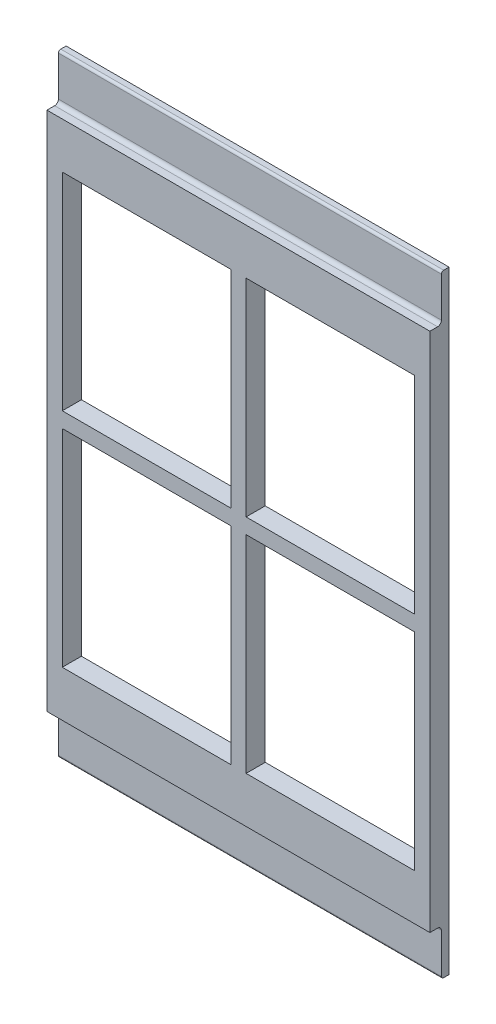
ISO-10303-21;
HEADER;
FILE_DESCRIPTION(('STEP AP214'),'2;1');
FILE_NAME('part.step','',(''),(''),'','','');
FILE_SCHEMA(('AUTOMOTIVE_DESIGN { 1 0 10303 214 1 1 1 1 }'));
ENDSEC;
DATA;
#1=APPLICATION_CONTEXT('core data for automotive mechanical design processes');
#2=APPLICATION_PROTOCOL_DEFINITION('international standard','automotive_design',2000,#1);
#3=PRODUCT_CONTEXT('',#1,'mechanical');
#4=PRODUCT('Part','Part','',(#3));
#5=PRODUCT_RELATED_PRODUCT_CATEGORY('part','',(#4));
#6=PRODUCT_DEFINITION_FORMATION('','',#4);
#7=PRODUCT_DEFINITION_CONTEXT('part definition',#1,'design');
#8=PRODUCT_DEFINITION('design','',#6,#7);
#9=PRODUCT_DEFINITION_SHAPE('','',#8);
#10=(LENGTH_UNIT() NAMED_UNIT(*) SI_UNIT(.MILLI.,.METRE.));
#11=(NAMED_UNIT(*) PLANE_ANGLE_UNIT() SI_UNIT($,.RADIAN.));
#12=(NAMED_UNIT(*) SI_UNIT($,.STERADIAN.) SOLID_ANGLE_UNIT());
#13=UNCERTAINTY_MEASURE_WITH_UNIT(LENGTH_MEASURE(1.E-05),#10,'distance_accuracy_value','');
#14=(GEOMETRIC_REPRESENTATION_CONTEXT(3) GLOBAL_UNCERTAINTY_ASSIGNED_CONTEXT((#13)) GLOBAL_UNIT_ASSIGNED_CONTEXT((#10,
#11,#12)) REPRESENTATION_CONTEXT('',''));
#15=CARTESIAN_POINT('',(0.,0.,0.));
#16=DIRECTION('',(0.,0.,1.));
#17=DIRECTION('',(1.,0.,0.));
#18=AXIS2_PLACEMENT_3D('',#15,#16,#17);
#19=CARTESIAN_POINT('',(-17.9629629629629,-37.8803703703704,2.5));
#20=DIRECTION('',(0.,0.,1.));
#21=DIRECTION('',(1.,0.,0.));
#22=AXIS2_PLACEMENT_3D('',#19,#20,#21);
#23=PLANE('',#22);
#24=DIRECTION('',(0.,-1.,0.));
#25=VECTOR('',#24,1.);
#26=CARTESIAN_POINT('',(-15.9629629629629,0.,2.5));
#27=LINE('',#26,#25);
#28=CARTESIAN_POINT('',(-15.9629629629629,1.12962962962963,2.5));
#29=VERTEX_POINT('',#28);
#30=CARTESIAN_POINT('',(-15.9629629629629,-25.8703703703704,2.5));
#31=VERTEX_POINT('',#30);
#32=EDGE_CURVE('E315',#29,#31,#27,.T.);
#33=ORIENTED_EDGE('',*,*,#32,.F.);
#34=DIRECTION('',(1.,0.,0.));
#35=VECTOR('',#34,1.);
#36=CARTESIAN_POINT('',(0.,1.12962962962963,2.5));
#37=LINE('',#36,#35);
#38=CARTESIAN_POINT('',(6.03703703703705,1.12962962962963,2.5));
#39=VERTEX_POINT('',#38);
#40=EDGE_CURVE('E343',#29,#39,#37,.T.);
#41=ORIENTED_EDGE('',*,*,#40,.T.);
#42=DIRECTION('',(0.,-1.,0.));
#43=VECTOR('',#42,1.);
#44=CARTESIAN_POINT('',(6.03703703703705,0.,2.5));
#45=LINE('',#44,#43);
#46=CARTESIAN_POINT('',(6.03703703703706,-25.8703703703704,2.5));
#47=VERTEX_POINT('',#46);
#48=EDGE_CURVE('E253',#39,#47,#45,.T.);
#49=ORIENTED_EDGE('',*,*,#48,.T.);
#50=DIRECTION('',(1.,0.,0.));
#51=VECTOR('',#50,1.);
#52=CARTESIAN_POINT('',(0.,-25.8703703703704,2.5));
#53=LINE('',#52,#51);
#54=EDGE_CURVE('E324',#31,#47,#53,.T.);
#55=ORIENTED_EDGE('',*,*,#54,.F.);
#56=EDGE_LOOP('',(#33,#41,#49,#55));
#57=FACE_BOUND('',#56,.T.);
#58=DIRECTION('',(0.,1.,0.));
#59=VECTOR('',#58,1.);
#60=CARTESIAN_POINT('',(-17.9629629629629,0.,2.5));
#61=LINE('',#60,#59);
#62=CARTESIAN_POINT('',(-17.9629629629629,-31.8703703703704,2.5));
#63=VERTEX_POINT('',#62);
#64=CARTESIAN_POINT('',(-17.9629629629629,36.1296296296296,2.5));
#65=VERTEX_POINT('',#64);
#66=EDGE_CURVE('E225',#63,#65,#61,.T.);
#67=ORIENTED_EDGE('',*,*,#66,.F.);
#68=DIRECTION('',(1.,0.,0.));
#69=VECTOR('',#68,1.);
#70=CARTESIAN_POINT('',(-17.9629629629629,-31.8703703703704,2.5));
#71=LINE('',#70,#69);
#72=CARTESIAN_POINT('',(32.0370370370371,-31.8703703703704,2.5));
#73=VERTEX_POINT('',#72);
#74=EDGE_CURVE('E241',#63,#73,#71,.T.);
#75=ORIENTED_EDGE('',*,*,#74,.T.);
#76=DIRECTION('',(0.,-1.,0.));
#77=VECTOR('',#76,1.);
#78=CARTESIAN_POINT('',(32.0370370370371,0.,2.5));
#79=LINE('',#78,#77);
#80=CARTESIAN_POINT('',(32.0370370370371,36.1296296296296,2.5));
#81=VERTEX_POINT('',#80);
#82=EDGE_CURVE('E243',#81,#73,#79,.T.);
#83=ORIENTED_EDGE('',*,*,#82,.F.);
#84=DIRECTION('',(1.,0.,0.));
#85=VECTOR('',#84,1.);
#86=CARTESIAN_POINT('',(-17.9629629629629,36.1296296296296,2.5));
#87=LINE('',#86,#85);
#88=EDGE_CURVE('E242',#65,#81,#87,.T.);
#89=ORIENTED_EDGE('',*,*,#88,.F.);
#90=EDGE_LOOP('',(#67,#75,#83,#89));
#91=FACE_BOUND('',#90,.T.);
#92=DIRECTION('',(0.,-1.,0.));
#93=VECTOR('',#92,1.);
#94=CARTESIAN_POINT('',(-15.9629629629629,0.,2.5));
#95=LINE('',#94,#93);
#96=CARTESIAN_POINT('',(-15.9629629629629,30.1321166393185,2.5));
#97=VERTEX_POINT('',#96);
#98=CARTESIAN_POINT('',(-15.9629629629629,3.12962962962963,2.5));
#99=VERTEX_POINT('',#98);
#100=EDGE_CURVE('E331',#97,#99,#95,.T.);
#101=ORIENTED_EDGE('',*,*,#100,.F.);
#102=DIRECTION('',(1.,0.,0.));
#103=VECTOR('',#102,1.);
#104=CARTESIAN_POINT('',(0.,30.1321166393185,2.5));
#105=LINE('',#104,#103);
#106=CARTESIAN_POINT('',(6.03703703703705,30.1321166393185,2.5));
#107=VERTEX_POINT('',#106);
#108=EDGE_CURVE('E244',#97,#107,#105,.T.);
#109=ORIENTED_EDGE('',*,*,#108,.T.);
#110=DIRECTION('',(0.,-1.,0.));
#111=VECTOR('',#110,1.);
#112=CARTESIAN_POINT('',(6.03703703703705,0.,2.5));
#113=LINE('',#112,#111);
#114=CARTESIAN_POINT('',(6.03703703703705,3.12962962962963,2.5));
#115=VERTEX_POINT('',#114);
#116=EDGE_CURVE('E337',#107,#115,#113,.T.);
#117=ORIENTED_EDGE('',*,*,#116,.T.);
#118=DIRECTION('',(1.,0.,0.));
#119=VECTOR('',#118,1.);
#120=CARTESIAN_POINT('',(0.,3.12962962962963,2.5));
#121=LINE('',#120,#119);
#122=EDGE_CURVE('E311',#99,#115,#121,.T.);
#123=ORIENTED_EDGE('',*,*,#122,.F.);
#124=EDGE_LOOP('',(#101,#109,#117,#123));
#125=FACE_BOUND('',#124,.T.);
#126=DIRECTION('',(0.,-1.,0.));
#127=VECTOR('',#126,1.);
#128=CARTESIAN_POINT('',(8.03703703703706,0.,2.5));
#129=LINE('',#128,#127);
#130=CARTESIAN_POINT('',(8.03703703703706,1.12962962962964,2.5));
#131=VERTEX_POINT('',#130);
#132=CARTESIAN_POINT('',(8.03703703703706,-25.8703703703704,2.5));
#133=VERTEX_POINT('',#132);
#134=EDGE_CURVE('E321',#131,#133,#129,.T.);
#135=ORIENTED_EDGE('',*,*,#134,.F.);
#136=DIRECTION('',(1.,0.,0.));
#137=VECTOR('',#136,1.);
#138=CARTESIAN_POINT('',(0.,1.12962962962963,2.5));
#139=LINE('',#138,#137);
#140=CARTESIAN_POINT('',(30.0370370370371,1.12962962962964,2.5));
#141=VERTEX_POINT('',#140);
#142=EDGE_CURVE('E250',#131,#141,#139,.T.);
#143=ORIENTED_EDGE('',*,*,#142,.T.);
#144=DIRECTION('',(0.,1.,0.));
#145=VECTOR('',#144,1.);
#146=CARTESIAN_POINT('',(30.0370370370371,0.,2.5));
#147=LINE('',#146,#145);
#148=CARTESIAN_POINT('',(30.0370370370371,-25.8703703703704,2.5));
#149=VERTEX_POINT('',#148);
#150=EDGE_CURVE('E319',#149,#141,#147,.T.);
#151=ORIENTED_EDGE('',*,*,#150,.F.);
#152=DIRECTION('',(1.,0.,0.));
#153=VECTOR('',#152,1.);
#154=CARTESIAN_POINT('',(0.,-25.8703703703704,2.5));
#155=LINE('',#154,#153);
#156=EDGE_CURVE('E313',#133,#149,#155,.T.);
#157=ORIENTED_EDGE('',*,*,#156,.F.);
#158=EDGE_LOOP('',(#135,#143,#151,#157));
#159=FACE_BOUND('',#158,.T.);
#160=DIRECTION('',(0.,-1.,0.));
#161=VECTOR('',#160,1.);
#162=CARTESIAN_POINT('',(8.03703703703706,0.,2.5));
#163=LINE('',#162,#161);
#164=CARTESIAN_POINT('',(8.03703703703705,30.1321166393185,2.5));
#165=VERTEX_POINT('',#164);
#166=CARTESIAN_POINT('',(8.03703703703706,3.12962962962963,2.5));
#167=VERTEX_POINT('',#166);
#168=EDGE_CURVE('E328',#165,#167,#163,.T.);
#169=ORIENTED_EDGE('',*,*,#168,.F.);
#170=DIRECTION('',(1.,0.,0.));
#171=VECTOR('',#170,1.);
#172=CARTESIAN_POINT('',(0.,30.1321166393185,2.5));
#173=LINE('',#172,#171);
#174=CARTESIAN_POINT('',(30.0370370370371,30.1321166393185,2.5));
#175=VERTEX_POINT('',#174);
#176=EDGE_CURVE('E340',#165,#175,#173,.T.);
#177=ORIENTED_EDGE('',*,*,#176,.T.);
#178=DIRECTION('',(0.,1.,0.));
#179=VECTOR('',#178,1.);
#180=CARTESIAN_POINT('',(30.0370370370371,0.,2.5));
#181=LINE('',#180,#179);
#182=CARTESIAN_POINT('',(30.0370370370371,3.12962962962964,2.5));
#183=VERTEX_POINT('',#182);
#184=EDGE_CURVE('E326',#183,#175,#181,.T.);
#185=ORIENTED_EDGE('',*,*,#184,.F.);
#186=DIRECTION('',(1.,0.,0.));
#187=VECTOR('',#186,1.);
#188=CARTESIAN_POINT('',(0.,3.12962962962963,2.5));
#189=LINE('',#188,#187);
#190=EDGE_CURVE('E317',#167,#183,#189,.T.);
#191=ORIENTED_EDGE('',*,*,#190,.F.);
#192=EDGE_LOOP('',(#169,#177,#185,#191));
#193=FACE_BOUND('',#192,.T.);
#194=ADVANCED_FACE('F35',(#57,#91,#125,#159,#193),#23,.T.);
#195=CARTESIAN_POINT('',(-17.9629629629629,0.,1.));
#196=DIRECTION('',(0.,0.,-1.));
#197=DIRECTION('',(0.,1.,0.));
#198=AXIS2_PLACEMENT_3D('',#195,#196,#197);
#199=PLANE('',#198);
#200=DIRECTION('',(0.,1.,0.));
#201=VECTOR('',#200,1.);
#202=CARTESIAN_POINT('',(32.0370370370371,0.,1.));
#203=LINE('',#202,#201);
#204=CARTESIAN_POINT('',(32.0370370370371,36.6296296296296,1.));
#205=VERTEX_POINT('',#204);
#206=CARTESIAN_POINT('',(32.0370370370371,41.8296296296297,1.));
#207=VERTEX_POINT('',#206);
#208=EDGE_CURVE('E43',#205,#207,#203,.T.);
#209=ORIENTED_EDGE('',*,*,#208,.T.);
#210=DIRECTION('',(1.,0.,0.));
#211=VECTOR('',#210,1.);
#212=CARTESIAN_POINT('',(-17.9629629629629,41.8296296296297,1.));
#213=LINE('',#212,#211);
#214=CARTESIAN_POINT('',(-17.9629629629629,41.8296296296297,1.));
#215=VERTEX_POINT('',#214);
#216=EDGE_CURVE('E509',#207,#215,#213,.F.);
#217=ORIENTED_EDGE('',*,*,#216,.T.);
#218=DIRECTION('',(0.,1.,0.));
#219=VECTOR('',#218,1.);
#220=CARTESIAN_POINT('',(-17.9629629629629,0.,1.));
#221=LINE('',#220,#219);
#222=CARTESIAN_POINT('',(-17.9629629629629,36.6296296296296,1.));
#223=VERTEX_POINT('',#222);
#224=EDGE_CURVE('E297',#223,#215,#221,.T.);
#225=ORIENTED_EDGE('',*,*,#224,.F.);
#226=DIRECTION('',(1.,0.,0.));
#227=VECTOR('',#226,1.);
#228=CARTESIAN_POINT('',(-17.9629629629629,36.6296296296296,1.));
#229=LINE('',#228,#227);
#230=EDGE_CURVE('E260',#223,#205,#229,.T.);
#231=ORIENTED_EDGE('',*,*,#230,.T.);
#232=EDGE_LOOP('',(#209,#217,#225,#231));
#233=FACE_BOUND('',#232,.T.);
#234=ADVANCED_FACE('F446',(#233),#199,.F.);
#235=CARTESIAN_POINT('',(0.,41.8296296296297,0.7));
#236=DIRECTION('',(-1.,0.,0.));
#237=DIRECTION('',(0.,0.,1.));
#238=AXIS2_PLACEMENT_3D('',#235,#236,#237);
#239=CYLINDRICAL_SURFACE('',#238,0.3);
#240=CARTESIAN_POINT('',(-17.9629629629629,41.8296296296297,0.7));
#241=DIRECTION('',(-1.,0.,0.));
#242=DIRECTION('',(0.,0.,1.));
#243=AXIS2_PLACEMENT_3D('',#240,#241,#242);
#244=CIRCLE('',#243,0.3);
#245=CARTESIAN_POINT('',(-17.9629629629629,42.1296296296296,0.7));
#246=VERTEX_POINT('',#245);
#247=EDGE_CURVE('E483',#215,#246,#244,.T.);
#248=ORIENTED_EDGE('',*,*,#247,.F.);
#249=ORIENTED_EDGE('',*,*,#216,.F.);
#250=CARTESIAN_POINT('',(32.0370370370371,41.8296296296297,0.7));
#251=DIRECTION('',(1.,0.,0.));
#252=DIRECTION('',(0.,1.,0.));
#253=AXIS2_PLACEMENT_3D('',#250,#251,#252);
#254=CIRCLE('',#253,0.3);
#255=CARTESIAN_POINT('',(32.0370370370371,42.1296296296296,0.7));
#256=VERTEX_POINT('',#255);
#257=EDGE_CURVE('E484',#256,#207,#254,.T.);
#258=ORIENTED_EDGE('',*,*,#257,.F.);
#259=DIRECTION('',(1.,0.,0.));
#260=VECTOR('',#259,1.);
#261=CARTESIAN_POINT('',(32.0370370370371,42.1296296296296,0.7));
#262=LINE('',#261,#260);
#263=EDGE_CURVE('E479',#246,#256,#262,.T.);
#264=ORIENTED_EDGE('',*,*,#263,.F.);
#265=EDGE_LOOP('',(#248,#249,#258,#264));
#266=FACE_BOUND('',#265,.T.);
#267=ADVANCED_FACE('F448',(#266),#239,.T.);
#268=CARTESIAN_POINT('',(0.,42.1296296296296,5.));
#269=DIRECTION('',(0.,1.,0.));
#270=DIRECTION('',(0.,0.,1.));
#271=AXIS2_PLACEMENT_3D('',#268,#269,#270);
#272=PLANE('',#271);
#273=DIRECTION('',(0.,0.,-1.));
#274=VECTOR('',#273,1.);
#275=CARTESIAN_POINT('',(-17.9629629629629,42.1296296296296,5.));
#276=LINE('',#275,#274);
#277=CARTESIAN_POINT('',(-17.9629629629629,42.1296296296296,0.));
#278=VERTEX_POINT('',#277);
#279=EDGE_CURVE('E272',#246,#278,#276,.T.);
#280=ORIENTED_EDGE('',*,*,#279,.F.);
#281=ORIENTED_EDGE('',*,*,#263,.T.);
#282=DIRECTION('',(0.,0.,-1.));
#283=VECTOR('',#282,1.);
#284=CARTESIAN_POINT('',(32.0370370370371,42.1296296296296,5.));
#285=LINE('',#284,#283);
#286=CARTESIAN_POINT('',(32.0370370370371,42.1296296296296,0.));
#287=VERTEX_POINT('',#286);
#288=EDGE_CURVE('E270',#256,#287,#285,.T.);
#289=ORIENTED_EDGE('',*,*,#288,.T.);
#290=DIRECTION('',(1.,0.,0.));
#291=VECTOR('',#290,1.);
#292=CARTESIAN_POINT('',(0.,42.1296296296296,0.));
#293=LINE('',#292,#291);
#294=EDGE_CURVE('E399',#278,#287,#293,.T.);
#295=ORIENTED_EDGE('',*,*,#294,.F.);
#296=EDGE_LOOP('',(#280,#281,#289,#295));
#297=FACE_BOUND('',#296,.T.);
#298=ADVANCED_FACE('F455',(#297),#272,.T.);
#299=CARTESIAN_POINT('',(0.,30.1321166393185,5.));
#300=DIRECTION('',(0.,1.,0.));
#301=DIRECTION('',(-1.,0.,0.));
#302=AXIS2_PLACEMENT_3D('',#299,#300,#301);
#303=PLANE('',#302);
#304=ORIENTED_EDGE('',*,*,#108,.F.);
#305=DIRECTION('',(0.,0.,-1.));
#306=VECTOR('',#305,1.);
#307=CARTESIAN_POINT('',(-15.9629629629629,30.1321166393185,5.));
#308=LINE('',#307,#306);
#309=CARTESIAN_POINT('',(-15.9629629629629,30.1321166393185,0.));
#310=VERTEX_POINT('',#309);
#311=EDGE_CURVE('E257',#97,#310,#308,.T.);
#312=ORIENTED_EDGE('',*,*,#311,.T.);
#313=DIRECTION('',(1.,0.,0.));
#314=VECTOR('',#313,1.);
#315=CARTESIAN_POINT('',(0.,30.1321166393185,0.));
#316=LINE('',#315,#314);
#317=CARTESIAN_POINT('',(6.03703703703705,30.1321166393185,0.));
#318=VERTEX_POINT('',#317);
#319=EDGE_CURVE('E383',#310,#318,#316,.T.);
#320=ORIENTED_EDGE('',*,*,#319,.T.);
#321=DIRECTION('',(0.,0.,-1.));
#322=VECTOR('',#321,1.);
#323=CARTESIAN_POINT('',(6.03703703703705,30.1321166393185,5.));
#324=LINE('',#323,#322);
#325=EDGE_CURVE('E259',#107,#318,#324,.T.);
#326=ORIENTED_EDGE('',*,*,#325,.F.);
#327=EDGE_LOOP('',(#304,#312,#320,#326));
#328=FACE_BOUND('',#327,.T.);
#329=ADVANCED_FACE('F431',(#328),#303,.F.);
#330=ORIENTED_EDGE('',*,*,#176,.F.);
#331=DIRECTION('',(0.,0.,-1.));
#332=VECTOR('',#331,1.);
#333=CARTESIAN_POINT('',(8.03703703703705,30.1321166393185,5.));
#334=LINE('',#333,#332);
#335=CARTESIAN_POINT('',(8.03703703703705,30.1321166393185,0.));
#336=VERTEX_POINT('',#335);
#337=EDGE_CURVE('E274',#165,#336,#334,.T.);
#338=ORIENTED_EDGE('',*,*,#337,.T.);
#339=CARTESIAN_POINT('',(30.0370370370371,30.1321166393185,0.));
#340=VERTEX_POINT('',#339);
#341=EDGE_CURVE('E391',#336,#340,#316,.T.);
#342=ORIENTED_EDGE('',*,*,#341,.T.);
#343=DIRECTION('',(0.,0.,-1.));
#344=VECTOR('',#343,1.);
#345=CARTESIAN_POINT('',(30.0370370370371,30.1321166393185,5.));
#346=LINE('',#345,#344);
#347=EDGE_CURVE('E276',#175,#340,#346,.T.);
#348=ORIENTED_EDGE('',*,*,#347,.F.);
#349=EDGE_LOOP('',(#330,#338,#342,#348));
#350=FACE_BOUND('',#349,.T.);
#351=ADVANCED_FACE('F474',(#350),#303,.F.);
#352=CARTESIAN_POINT('',(6.03703703703705,0.,5.));
#353=DIRECTION('',(1.,0.,0.));
#354=DIRECTION('',(0.,1.,0.));
#355=AXIS2_PLACEMENT_3D('',#352,#353,#354);
#356=PLANE('',#355);
#357=ORIENTED_EDGE('',*,*,#48,.F.);
#358=DIRECTION('',(0.,0.,-1.));
#359=VECTOR('',#358,1.);
#360=CARTESIAN_POINT('',(6.03703703703705,1.12962962962963,5.));
#361=LINE('',#360,#359);
#362=CARTESIAN_POINT('',(6.03703703703705,1.12962962962963,0.));
#363=VERTEX_POINT('',#362);
#364=EDGE_CURVE('E282',#39,#363,#361,.T.);
#365=ORIENTED_EDGE('',*,*,#364,.T.);
#366=DIRECTION('',(0.,-1.,0.));
#367=VECTOR('',#366,1.);
#368=CARTESIAN_POINT('',(6.03703703703705,0.,0.));
#369=LINE('',#368,#367);
#370=CARTESIAN_POINT('',(6.03703703703706,-25.8703703703704,0.));
#371=VERTEX_POINT('',#370);
#372=EDGE_CURVE('E356',#363,#371,#369,.T.);
#373=ORIENTED_EDGE('',*,*,#372,.T.);
#374=DIRECTION('',(0.,0.,-1.));
#375=VECTOR('',#374,1.);
#376=CARTESIAN_POINT('',(6.03703703703706,-25.8703703703704,5.));
#377=LINE('',#376,#375);
#378=EDGE_CURVE('E284',#47,#371,#377,.T.);
#379=ORIENTED_EDGE('',*,*,#378,.F.);
#380=EDGE_LOOP('',(#357,#365,#373,#379));
#381=FACE_BOUND('',#380,.T.);
#382=ADVANCED_FACE('F354',(#381),#356,.F.);
#383=CARTESIAN_POINT('',(0.,1.12962962962963,5.));
#384=DIRECTION('',(0.,1.,0.));
#385=DIRECTION('',(-1.,0.,0.));
#386=AXIS2_PLACEMENT_3D('',#383,#384,#385);
#387=PLANE('',#386);
#388=ORIENTED_EDGE('',*,*,#142,.F.);
#389=DIRECTION('',(0.,0.,-1.));
#390=VECTOR('',#389,1.);
#391=CARTESIAN_POINT('',(8.03703703703706,1.12962962962964,5.));
#392=LINE('',#391,#390);
#393=CARTESIAN_POINT('',(8.03703703703706,1.12962962962964,0.));
#394=VERTEX_POINT('',#393);
#395=EDGE_CURVE('E50',#131,#394,#392,.T.);
#396=ORIENTED_EDGE('',*,*,#395,.T.);
#397=DIRECTION('',(1.,0.,0.));
#398=VECTOR('',#397,1.);
#399=CARTESIAN_POINT('',(0.,1.12962962962963,0.));
#400=LINE('',#399,#398);
#401=CARTESIAN_POINT('',(30.0370370370371,1.12962962962964,0.));
#402=VERTEX_POINT('',#401);
#403=EDGE_CURVE('E536',#394,#402,#400,.T.);
#404=ORIENTED_EDGE('',*,*,#403,.T.);
#405=DIRECTION('',(0.,0.,-1.));
#406=VECTOR('',#405,1.);
#407=CARTESIAN_POINT('',(30.0370370370371,1.12962962962964,5.));
#408=LINE('',#407,#406);
#409=EDGE_CURVE('E58',#141,#402,#408,.T.);
#410=ORIENTED_EDGE('',*,*,#409,.F.);
#411=EDGE_LOOP('',(#388,#396,#404,#410));
#412=FACE_BOUND('',#411,.T.);
#413=ADVANCED_FACE('F583',(#412),#387,.F.);
#414=CARTESIAN_POINT('',(0.,0.,0.));
#415=DIRECTION('',(0.,0.,1.));
#416=DIRECTION('',(1.,0.,0.));
#417=AXIS2_PLACEMENT_3D('',#414,#415,#416);
#418=PLANE('',#417);
#419=DIRECTION('',(0.,-1.,0.));
#420=VECTOR('',#419,1.);
#421=CARTESIAN_POINT('',(8.03703703703706,0.,0.));
#422=LINE('',#421,#420);
#423=CARTESIAN_POINT('',(8.03703703703706,-25.8703703703704,0.));
#424=VERTEX_POINT('',#423);
#425=EDGE_CURVE('E418',#394,#424,#422,.T.);
#426=ORIENTED_EDGE('',*,*,#425,.T.);
#427=DIRECTION('',(1.,0.,0.));
#428=VECTOR('',#427,1.);
#429=CARTESIAN_POINT('',(0.,-25.8703703703704,0.));
#430=LINE('',#429,#428);
#431=CARTESIAN_POINT('',(30.0370370370371,-25.8703703703704,0.));
#432=VERTEX_POINT('',#431);
#433=EDGE_CURVE('E378',#424,#432,#430,.T.);
#434=ORIENTED_EDGE('',*,*,#433,.T.);
#435=DIRECTION('',(0.,1.,0.));
#436=VECTOR('',#435,1.);
#437=CARTESIAN_POINT('',(30.0370370370371,0.,0.));
#438=LINE('',#437,#436);
#439=EDGE_CURVE('E539',#432,#402,#438,.T.);
#440=ORIENTED_EDGE('',*,*,#439,.T.);
#441=ORIENTED_EDGE('',*,*,#403,.F.);
#442=EDGE_LOOP('',(#426,#434,#440,#441));
#443=FACE_BOUND('',#442,.T.);
#444=DIRECTION('',(1.,0.,0.));
#445=VECTOR('',#444,1.);
#446=CARTESIAN_POINT('',(0.,1.12962962962963,0.));
#447=LINE('',#446,#445);
#448=CARTESIAN_POINT('',(-15.9629629629629,1.12962962962963,0.));
#449=VERTEX_POINT('',#448);
#450=EDGE_CURVE('E372',#449,#363,#447,.T.);
#451=ORIENTED_EDGE('',*,*,#450,.F.);
#452=DIRECTION('',(0.,-1.,0.));
#453=VECTOR('',#452,1.);
#454=CARTESIAN_POINT('',(-15.9629629629629,0.,0.));
#455=LINE('',#454,#453);
#456=CARTESIAN_POINT('',(-15.9629629629629,-25.8703703703704,0.));
#457=VERTEX_POINT('',#456);
#458=EDGE_CURVE('E367',#449,#457,#455,.T.);
#459=ORIENTED_EDGE('',*,*,#458,.T.);
#460=EDGE_CURVE('E361',#457,#371,#430,.T.);
#461=ORIENTED_EDGE('',*,*,#460,.T.);
#462=ORIENTED_EDGE('',*,*,#372,.F.);
#463=EDGE_LOOP('',(#451,#459,#461,#462));
#464=FACE_BOUND('',#463,.T.);
#465=CARTESIAN_POINT('',(8.03703703703706,3.12962962962963,0.));
#466=VERTEX_POINT('',#465);
#467=EDGE_CURVE('E415',#336,#466,#422,.T.);
#468=ORIENTED_EDGE('',*,*,#467,.T.);
#469=DIRECTION('',(1.,0.,0.));
#470=VECTOR('',#469,1.);
#471=CARTESIAN_POINT('',(0.,3.12962962962963,0.));
#472=LINE('',#471,#470);
#473=CARTESIAN_POINT('',(30.0370370370371,3.12962962962964,0.));
#474=VERTEX_POINT('',#473);
#475=EDGE_CURVE('E411',#466,#474,#472,.T.);
#476=ORIENTED_EDGE('',*,*,#475,.T.);
#477=EDGE_CURVE('E413',#474,#340,#438,.T.);
#478=ORIENTED_EDGE('',*,*,#477,.T.);
#479=ORIENTED_EDGE('',*,*,#341,.F.);
#480=EDGE_LOOP('',(#468,#476,#478,#479));
#481=FACE_BOUND('',#480,.T.);
#482=DIRECTION('',(0.,1.,0.));
#483=VECTOR('',#482,1.);
#484=CARTESIAN_POINT('',(-17.9629629629629,0.,0.));
#485=LINE('',#484,#483);
#486=CARTESIAN_POINT('',(-17.9629629629629,-37.8703703703704,0.));
#487=VERTEX_POINT('',#486);
#488=EDGE_CURVE('E408',#487,#278,#485,.T.);
#489=ORIENTED_EDGE('',*,*,#488,.T.);
#490=ORIENTED_EDGE('',*,*,#294,.T.);
#491=DIRECTION('',(0.,-1.,0.));
#492=VECTOR('',#491,1.);
#493=CARTESIAN_POINT('',(32.0370370370371,0.,0.));
#494=LINE('',#493,#492);
#495=CARTESIAN_POINT('',(32.0370370370371,-37.8703703703704,0.));
#496=VERTEX_POINT('',#495);
#497=EDGE_CURVE('E402',#287,#496,#494,.T.);
#498=ORIENTED_EDGE('',*,*,#497,.T.);
#499=DIRECTION('',(1.,0.,0.));
#500=VECTOR('',#499,1.);
#501=CARTESIAN_POINT('',(0.,-37.8703703703704,0.));
#502=LINE('',#501,#500);
#503=EDGE_CURVE('E405',#487,#496,#502,.T.);
#504=ORIENTED_EDGE('',*,*,#503,.F.);
#505=EDGE_LOOP('',(#489,#490,#498,#504));
#506=FACE_BOUND('',#505,.T.);
#507=CARTESIAN_POINT('',(-15.9629629629629,3.12962962962963,0.));
#508=VERTEX_POINT('',#507);
#509=EDGE_CURVE('E389',#310,#508,#455,.T.);
#510=ORIENTED_EDGE('',*,*,#509,.T.);
#511=DIRECTION('',(1.,0.,0.));
#512=VECTOR('',#511,1.);
#513=CARTESIAN_POINT('',(0.,3.12962962962963,0.));
#514=LINE('',#513,#512);
#515=CARTESIAN_POINT('',(6.03703703703705,3.12962962962963,0.));
#516=VERTEX_POINT('',#515);
#517=EDGE_CURVE('E295',#508,#516,#514,.T.);
#518=ORIENTED_EDGE('',*,*,#517,.T.);
#519=EDGE_CURVE('E377',#318,#516,#369,.T.);
#520=ORIENTED_EDGE('',*,*,#519,.F.);
#521=ORIENTED_EDGE('',*,*,#319,.F.);
#522=EDGE_LOOP('',(#510,#518,#520,#521));
#523=FACE_BOUND('',#522,.T.);
#524=ADVANCED_FACE('F374',(#443,#464,#481,#506,#523),#418,.F.);
#525=ORIENTED_EDGE('',*,*,#116,.F.);
#526=ORIENTED_EDGE('',*,*,#325,.T.);
#527=ORIENTED_EDGE('',*,*,#519,.T.);
#528=DIRECTION('',(0.,0.,-1.));
#529=VECTOR('',#528,1.);
#530=CARTESIAN_POINT('',(6.03703703703705,3.12962962962963,5.));
#531=LINE('',#530,#529);
#532=EDGE_CURVE('E262',#115,#516,#531,.T.);
#533=ORIENTED_EDGE('',*,*,#532,.F.);
#534=EDGE_LOOP('',(#525,#526,#527,#533));
#535=FACE_BOUND('',#534,.T.);
#536=ADVANCED_FACE('F426',(#535),#356,.F.);
#537=CARTESIAN_POINT('',(-15.9629629629629,0.,5.));
#538=DIRECTION('',(1.,0.,0.));
#539=DIRECTION('',(0.,1.,0.));
#540=AXIS2_PLACEMENT_3D('',#537,#538,#539);
#541=PLANE('',#540);
#542=ORIENTED_EDGE('',*,*,#311,.F.);
#543=ORIENTED_EDGE('',*,*,#100,.T.);
#544=DIRECTION('',(0.,0.,-1.));
#545=VECTOR('',#544,1.);
#546=CARTESIAN_POINT('',(-15.9629629629629,3.12962962962963,5.));
#547=LINE('',#546,#545);
#548=EDGE_CURVE('E264',#99,#508,#547,.T.);
#549=ORIENTED_EDGE('',*,*,#548,.T.);
#550=ORIENTED_EDGE('',*,*,#509,.F.);
#551=EDGE_LOOP('',(#542,#543,#549,#550));
#552=FACE_BOUND('',#551,.T.);
#553=ADVANCED_FACE('F432',(#552),#541,.T.);
#554=CARTESIAN_POINT('',(0.,3.12962962962963,5.));
#555=DIRECTION('',(0.,1.,0.));
#556=DIRECTION('',(-1.,0.,0.));
#557=AXIS2_PLACEMENT_3D('',#554,#555,#556);
#558=PLANE('',#557);
#559=ORIENTED_EDGE('',*,*,#548,.F.);
#560=ORIENTED_EDGE('',*,*,#122,.T.);
#561=ORIENTED_EDGE('',*,*,#532,.T.);
#562=ORIENTED_EDGE('',*,*,#517,.F.);
#563=EDGE_LOOP('',(#559,#560,#561,#562));
#564=FACE_BOUND('',#563,.T.);
#565=ADVANCED_FACE('F424',(#564),#558,.T.);
#566=CARTESIAN_POINT('',(30.0370370370371,0.,5.));
#567=DIRECTION('',(-1.,0.,0.));
#568=DIRECTION('',(0.,-1.,0.));
#569=AXIS2_PLACEMENT_3D('',#566,#567,#568);
#570=PLANE('',#569);
#571=DIRECTION('',(0.,0.,-1.));
#572=VECTOR('',#571,1.);
#573=CARTESIAN_POINT('',(30.0370370370371,-25.8703703703704,5.));
#574=LINE('',#573,#572);
#575=EDGE_CURVE('E292',#149,#432,#574,.T.);
#576=ORIENTED_EDGE('',*,*,#575,.F.);
#577=ORIENTED_EDGE('',*,*,#150,.T.);
#578=ORIENTED_EDGE('',*,*,#409,.T.);
#579=ORIENTED_EDGE('',*,*,#439,.F.);
#580=EDGE_LOOP('',(#576,#577,#578,#579));
#581=FACE_BOUND('',#580,.T.);
#582=ADVANCED_FACE('F439',(#581),#570,.T.);
#583=CARTESIAN_POINT('',(8.03703703703706,0.,5.));
#584=DIRECTION('',(1.,0.,0.));
#585=DIRECTION('',(0.,1.,0.));
#586=AXIS2_PLACEMENT_3D('',#583,#584,#585);
#587=PLANE('',#586);
#588=ORIENTED_EDGE('',*,*,#395,.F.);
#589=ORIENTED_EDGE('',*,*,#134,.T.);
#590=DIRECTION('',(0.,0.,-1.));
#591=VECTOR('',#590,1.);
#592=CARTESIAN_POINT('',(8.03703703703706,-25.8703703703704,5.));
#593=LINE('',#592,#591);
#594=EDGE_CURVE('E294',#133,#424,#593,.T.);
#595=ORIENTED_EDGE('',*,*,#594,.T.);
#596=ORIENTED_EDGE('',*,*,#425,.F.);
#597=EDGE_LOOP('',(#588,#589,#595,#596));
#598=FACE_BOUND('',#597,.T.);
#599=ADVANCED_FACE('F551',(#598),#587,.T.);
#600=CARTESIAN_POINT('',(0.,-25.8703703703704,5.));
#601=DIRECTION('',(0.,1.,0.));
#602=DIRECTION('',(-1.,0.,0.));
#603=AXIS2_PLACEMENT_3D('',#600,#601,#602);
#604=PLANE('',#603);
#605=ORIENTED_EDGE('',*,*,#594,.F.);
#606=ORIENTED_EDGE('',*,*,#156,.T.);
#607=ORIENTED_EDGE('',*,*,#575,.T.);
#608=ORIENTED_EDGE('',*,*,#433,.F.);
#609=EDGE_LOOP('',(#605,#606,#607,#608));
#610=FACE_BOUND('',#609,.T.);
#611=ADVANCED_FACE('F547',(#610),#604,.T.);
#612=DIRECTION('',(0.,0.,-1.));
#613=VECTOR('',#612,1.);
#614=CARTESIAN_POINT('',(-15.9629629629629,-25.8703703703704,5.));
#615=LINE('',#614,#613);
#616=EDGE_CURVE('E286',#31,#457,#615,.T.);
#617=ORIENTED_EDGE('',*,*,#616,.F.);
#618=ORIENTED_EDGE('',*,*,#54,.T.);
#619=ORIENTED_EDGE('',*,*,#378,.T.);
#620=ORIENTED_EDGE('',*,*,#460,.F.);
#621=EDGE_LOOP('',(#617,#618,#619,#620));
#622=FACE_BOUND('',#621,.T.);
#623=ADVANCED_FACE('F360',(#622),#604,.T.);
#624=CARTESIAN_POINT('',(0.,1.12962962962963,5.));
#625=DIRECTION('',(0.,1.,0.));
#626=DIRECTION('',(-1.,0.,0.));
#627=AXIS2_PLACEMENT_3D('',#624,#625,#626);
#628=PLANE('',#627);
#629=ORIENTED_EDGE('',*,*,#40,.F.);
#630=DIRECTION('',(0.,0.,-1.));
#631=VECTOR('',#630,1.);
#632=CARTESIAN_POINT('',(-15.9629629629629,1.12962962962963,5.));
#633=LINE('',#632,#631);
#634=EDGE_CURVE('E288',#29,#449,#633,.T.);
#635=ORIENTED_EDGE('',*,*,#634,.T.);
#636=ORIENTED_EDGE('',*,*,#450,.T.);
#637=ORIENTED_EDGE('',*,*,#364,.F.);
#638=EDGE_LOOP('',(#629,#635,#636,#637));
#639=FACE_BOUND('',#638,.T.);
#640=ADVANCED_FACE('F369',(#639),#628,.F.);
#641=ORIENTED_EDGE('',*,*,#634,.F.);
#642=ORIENTED_EDGE('',*,*,#32,.T.);
#643=ORIENTED_EDGE('',*,*,#616,.T.);
#644=ORIENTED_EDGE('',*,*,#458,.F.);
#645=EDGE_LOOP('',(#641,#642,#643,#644));
#646=FACE_BOUND('',#645,.T.);
#647=ADVANCED_FACE('F366',(#646),#541,.T.);
#648=DIRECTION('',(0.,0.,-1.));
#649=VECTOR('',#648,1.);
#650=CARTESIAN_POINT('',(30.0370370370371,3.12962962962964,5.));
#651=LINE('',#650,#649);
#652=EDGE_CURVE('E278',#183,#474,#651,.T.);
#653=ORIENTED_EDGE('',*,*,#652,.F.);
#654=ORIENTED_EDGE('',*,*,#184,.T.);
#655=ORIENTED_EDGE('',*,*,#347,.T.);
#656=ORIENTED_EDGE('',*,*,#477,.F.);
#657=EDGE_LOOP('',(#653,#654,#655,#656));
#658=FACE_BOUND('',#657,.T.);
#659=ADVANCED_FACE('F445',(#658),#570,.T.);
#660=ORIENTED_EDGE('',*,*,#337,.F.);
#661=ORIENTED_EDGE('',*,*,#168,.T.);
#662=DIRECTION('',(0.,0.,-1.));
#663=VECTOR('',#662,1.);
#664=CARTESIAN_POINT('',(8.03703703703706,3.12962962962963,5.));
#665=LINE('',#664,#663);
#666=EDGE_CURVE('E280',#167,#466,#665,.T.);
#667=ORIENTED_EDGE('',*,*,#666,.T.);
#668=ORIENTED_EDGE('',*,*,#467,.F.);
#669=EDGE_LOOP('',(#660,#661,#667,#668));
#670=FACE_BOUND('',#669,.T.);
#671=ADVANCED_FACE('F558',(#670),#587,.T.);
#672=CARTESIAN_POINT('',(0.,3.12962962962963,5.));
#673=DIRECTION('',(0.,1.,0.));
#674=DIRECTION('',(-1.,0.,0.));
#675=AXIS2_PLACEMENT_3D('',#672,#673,#674);
#676=PLANE('',#675);
#677=ORIENTED_EDGE('',*,*,#666,.F.);
#678=ORIENTED_EDGE('',*,*,#190,.T.);
#679=ORIENTED_EDGE('',*,*,#652,.T.);
#680=ORIENTED_EDGE('',*,*,#475,.F.);
#681=EDGE_LOOP('',(#677,#678,#679,#680));
#682=FACE_BOUND('',#681,.T.);
#683=ADVANCED_FACE('F565',(#682),#676,.T.);
#684=CARTESIAN_POINT('',(0.,-37.8703703703704,5.));
#685=DIRECTION('',(0.,1.,0.));
#686=DIRECTION('',(0.,0.,1.));
#687=AXIS2_PLACEMENT_3D('',#684,#685,#686);
#688=PLANE('',#687);
#689=DIRECTION('',(0.,0.,-1.));
#690=VECTOR('',#689,1.);
#691=CARTESIAN_POINT('',(32.0370370370371,-37.8703703703704,5.));
#692=LINE('',#691,#690);
#693=CARTESIAN_POINT('',(32.0370370370371,-37.8703703703704,0.7));
#694=VERTEX_POINT('',#693);
#695=EDGE_CURVE('E268',#694,#496,#692,.T.);
#696=ORIENTED_EDGE('',*,*,#695,.F.);
#697=DIRECTION('',(1.,0.,0.));
#698=VECTOR('',#697,1.);
#699=CARTESIAN_POINT('',(-17.9629629629629,-37.8703703703704,0.7));
#700=LINE('',#699,#698);
#701=CARTESIAN_POINT('',(-17.9629629629629,-37.8703703703704,0.7));
#702=VERTEX_POINT('',#701);
#703=EDGE_CURVE('E310',#694,#702,#700,.F.);
#704=ORIENTED_EDGE('',*,*,#703,.T.);
#705=DIRECTION('',(0.,0.,-1.));
#706=VECTOR('',#705,1.);
#707=CARTESIAN_POINT('',(-17.9629629629629,-37.8703703703704,5.));
#708=LINE('',#707,#706);
#709=EDGE_CURVE('E266',#702,#487,#708,.T.);
#710=ORIENTED_EDGE('',*,*,#709,.T.);
#711=ORIENTED_EDGE('',*,*,#503,.T.);
#712=EDGE_LOOP('',(#696,#704,#710,#711));
#713=FACE_BOUND('',#712,.T.);
#714=ADVANCED_FACE('F522',(#713),#688,.F.);
#715=CARTESIAN_POINT('',(-17.9629629629629,-37.5703703703704,0.7));
#716=DIRECTION('',(-1.,0.,0.));
#717=DIRECTION('',(0.,0.,1.));
#718=AXIS2_PLACEMENT_3D('',#715,#716,#717);
#719=CYLINDRICAL_SURFACE('',#718,0.3);
#720=CARTESIAN_POINT('',(-17.9629629629629,-37.5703703703704,0.7));
#721=DIRECTION('',(-1.,0.,0.));
#722=DIRECTION('',(0.,0.,1.));
#723=AXIS2_PLACEMENT_3D('',#720,#721,#722);
#724=CIRCLE('',#723,0.3);
#725=CARTESIAN_POINT('',(-17.9629629629629,-37.5703703703704,1.));
#726=VERTEX_POINT('',#725);
#727=EDGE_CURVE('E510',#702,#726,#724,.T.);
#728=ORIENTED_EDGE('',*,*,#727,.F.);
#729=ORIENTED_EDGE('',*,*,#703,.F.);
#730=CARTESIAN_POINT('',(32.0370370370371,-37.5703703703704,0.7));
#731=DIRECTION('',(1.,0.,0.));
#732=DIRECTION('',(0.,1.,0.));
#733=AXIS2_PLACEMENT_3D('',#730,#731,#732);
#734=CIRCLE('',#733,0.3);
#735=CARTESIAN_POINT('',(32.0370370370371,-37.5703703703704,1.));
#736=VERTEX_POINT('',#735);
#737=EDGE_CURVE('E485',#736,#694,#734,.T.);
#738=ORIENTED_EDGE('',*,*,#737,.F.);
#739=DIRECTION('',(1.,0.,0.));
#740=VECTOR('',#739,1.);
#741=CARTESIAN_POINT('',(32.0370370370371,-37.5703703703704,1.));
#742=LINE('',#741,#740);
#743=EDGE_CURVE('E515',#726,#736,#742,.T.);
#744=ORIENTED_EDGE('',*,*,#743,.F.);
#745=EDGE_LOOP('',(#728,#729,#738,#744));
#746=FACE_BOUND('',#745,.T.);
#747=ADVANCED_FACE('F528',(#746),#719,.T.);
#748=CARTESIAN_POINT('',(-17.9629629629629,0.,1.));
#749=DIRECTION('',(0.,0.,1.));
#750=DIRECTION('',(0.,-1.,0.));
#751=AXIS2_PLACEMENT_3D('',#748,#749,#750);
#752=PLANE('',#751);
#753=DIRECTION('',(0.,-1.,0.));
#754=VECTOR('',#753,1.);
#755=CARTESIAN_POINT('',(-17.9629629629629,0.,1.));
#756=LINE('',#755,#754);
#757=CARTESIAN_POINT('',(-17.9629629629629,-32.3703703703704,1.));
#758=VERTEX_POINT('',#757);
#759=EDGE_CURVE('E235',#758,#726,#756,.T.);
#760=ORIENTED_EDGE('',*,*,#759,.T.);
#761=ORIENTED_EDGE('',*,*,#743,.T.);
#762=DIRECTION('',(0.,-1.,0.));
#763=VECTOR('',#762,1.);
#764=CARTESIAN_POINT('',(32.0370370370371,0.,1.));
#765=LINE('',#764,#763);
#766=CARTESIAN_POINT('',(32.0370370370371,-32.3703703703704,1.));
#767=VERTEX_POINT('',#766);
#768=EDGE_CURVE('E234',#767,#736,#765,.T.);
#769=ORIENTED_EDGE('',*,*,#768,.F.);
#770=DIRECTION('',(1.,0.,0.));
#771=VECTOR('',#770,1.);
#772=CARTESIAN_POINT('',(-17.9629629629629,-32.3703703703704,1.));
#773=LINE('',#772,#771);
#774=EDGE_CURVE('E497',#767,#758,#773,.F.);
#775=ORIENTED_EDGE('',*,*,#774,.T.);
#776=EDGE_LOOP('',(#760,#761,#769,#775));
#777=FACE_BOUND('',#776,.T.);
#778=ADVANCED_FACE('F460',(#777),#752,.T.);
#779=CARTESIAN_POINT('',(-17.9629629629629,-32.3703703703704,1.5));
#780=DIRECTION('',(1.,0.,0.));
#781=DIRECTION('',(0.,0.,-1.));
#782=AXIS2_PLACEMENT_3D('',#779,#780,#781);
#783=CYLINDRICAL_SURFACE('',#782,0.5);
#784=CARTESIAN_POINT('',(-17.9629629629629,-32.3703703703704,1.5));
#785=DIRECTION('',(-1.,0.,0.));
#786=DIRECTION('',(0.,0.,1.));
#787=AXIS2_PLACEMENT_3D('',#784,#785,#786);
#788=CIRCLE('',#787,0.5);
#789=CARTESIAN_POINT('',(-17.9629629629629,-31.8703703703704,1.5));
#790=VERTEX_POINT('',#789);
#791=EDGE_CURVE('E229',#758,#790,#788,.F.);
#792=ORIENTED_EDGE('',*,*,#791,.F.);
#793=ORIENTED_EDGE('',*,*,#774,.F.);
#794=CARTESIAN_POINT('',(32.0370370370371,-32.3703703703704,1.5));
#795=DIRECTION('',(1.,0.,0.));
#796=DIRECTION('',(0.,1.,0.));
#797=AXIS2_PLACEMENT_3D('',#794,#795,#796);
#798=CIRCLE('',#797,0.5);
#799=CARTESIAN_POINT('',(32.0370370370371,-31.8703703703704,1.5));
#800=VERTEX_POINT('',#799);
#801=EDGE_CURVE('E487',#800,#767,#798,.F.);
#802=ORIENTED_EDGE('',*,*,#801,.F.);
#803=DIRECTION('',(1.,0.,0.));
#804=VECTOR('',#803,1.);
#805=CARTESIAN_POINT('',(-17.9629629629629,-31.8703703703704,1.5));
#806=LINE('',#805,#804);
#807=EDGE_CURVE('E499',#790,#800,#806,.T.);
#808=ORIENTED_EDGE('',*,*,#807,.F.);
#809=EDGE_LOOP('',(#792,#793,#802,#808));
#810=FACE_BOUND('',#809,.T.);
#811=ADVANCED_FACE('F534',(#810),#783,.F.);
#812=CARTESIAN_POINT('',(-17.9629629629629,36.6296296296296,1.5));
#813=DIRECTION('',(1.,0.,0.));
#814=DIRECTION('',(0.,0.,-1.));
#815=AXIS2_PLACEMENT_3D('',#812,#813,#814);
#816=CYLINDRICAL_SURFACE('',#815,0.5);
#817=CARTESIAN_POINT('',(-17.9629629629629,36.6296296296296,1.5));
#818=DIRECTION('',(-1.,0.,0.));
#819=DIRECTION('',(0.,0.,1.));
#820=AXIS2_PLACEMENT_3D('',#817,#818,#819);
#821=CIRCLE('',#820,0.5);
#822=CARTESIAN_POINT('',(-17.9629629629629,36.1296296296296,1.5));
#823=VERTEX_POINT('',#822);
#824=EDGE_CURVE('E493',#823,#223,#821,.F.);
#825=ORIENTED_EDGE('',*,*,#824,.F.);
#826=DIRECTION('',(1.,0.,0.));
#827=VECTOR('',#826,1.);
#828=CARTESIAN_POINT('',(-17.9629629629629,36.1296296296296,1.5));
#829=LINE('',#828,#827);
#830=CARTESIAN_POINT('',(32.0370370370371,36.1296296296296,1.5));
#831=VERTEX_POINT('',#830);
#832=EDGE_CURVE('E500',#831,#823,#829,.F.);
#833=ORIENTED_EDGE('',*,*,#832,.F.);
#834=CARTESIAN_POINT('',(32.0370370370371,36.6296296296296,1.5));
#835=DIRECTION('',(1.,0.,0.));
#836=DIRECTION('',(0.,1.,0.));
#837=AXIS2_PLACEMENT_3D('',#834,#835,#836);
#838=CIRCLE('',#837,0.5);
#839=EDGE_CURVE('E495',#205,#831,#838,.F.);
#840=ORIENTED_EDGE('',*,*,#839,.F.);
#841=ORIENTED_EDGE('',*,*,#230,.F.);
#842=EDGE_LOOP('',(#825,#833,#840,#841));
#843=FACE_BOUND('',#842,.T.);
#844=ADVANCED_FACE('F467',(#843),#816,.F.);
#845=CARTESIAN_POINT('',(32.0370370370371,0.,5.));
#846=DIRECTION('',(1.,0.,0.));
#847=DIRECTION('',(0.,1.,0.));
#848=AXIS2_PLACEMENT_3D('',#845,#846,#847);
#849=PLANE('',#848);
#850=DIRECTION('',(0.,0.,1.));
#851=VECTOR('',#850,1.);
#852=CARTESIAN_POINT('',(32.0370370370371,36.1296296296296,0.));
#853=LINE('',#852,#851);
#854=EDGE_CURVE('E11',#831,#81,#853,.T.);
#855=ORIENTED_EDGE('',*,*,#854,.T.);
#856=ORIENTED_EDGE('',*,*,#82,.T.);
#857=DIRECTION('',(0.,0.,1.));
#858=VECTOR('',#857,1.);
#859=CARTESIAN_POINT('',(32.0370370370371,-31.8703703703704,0.));
#860=LINE('',#859,#858);
#861=EDGE_CURVE('E248',#800,#73,#860,.T.);
#862=ORIENTED_EDGE('',*,*,#861,.F.);
#863=ORIENTED_EDGE('',*,*,#801,.T.);
#864=ORIENTED_EDGE('',*,*,#768,.T.);
#865=ORIENTED_EDGE('',*,*,#737,.T.);
#866=ORIENTED_EDGE('',*,*,#695,.T.);
#867=ORIENTED_EDGE('',*,*,#497,.F.);
#868=ORIENTED_EDGE('',*,*,#288,.F.);
#869=ORIENTED_EDGE('',*,*,#257,.T.);
#870=ORIENTED_EDGE('',*,*,#208,.F.);
#871=ORIENTED_EDGE('',*,*,#839,.T.);
#872=EDGE_LOOP('',(#855,#856,#862,#863,#864,#865,#866,#867,#868,#869,#870,#871));
#873=FACE_BOUND('',#872,.T.);
#874=ADVANCED_FACE('F465',(#873),#849,.T.);
#875=CARTESIAN_POINT('',(-17.9629629629629,0.,5.));
#876=DIRECTION('',(-1.,0.,0.));
#877=DIRECTION('',(0.,0.,1.));
#878=AXIS2_PLACEMENT_3D('',#875,#876,#877);
#879=PLANE('',#878);
#880=DIRECTION('',(0.,0.,1.));
#881=VECTOR('',#880,1.);
#882=CARTESIAN_POINT('',(-17.9629629629629,-31.8703703703704,0.));
#883=LINE('',#882,#881);
#884=EDGE_CURVE('E221',#790,#63,#883,.T.);
#885=ORIENTED_EDGE('',*,*,#884,.T.);
#886=ORIENTED_EDGE('',*,*,#66,.T.);
#887=DIRECTION('',(0.,0.,1.));
#888=VECTOR('',#887,1.);
#889=CARTESIAN_POINT('',(-17.9629629629629,36.1296296296296,0.));
#890=LINE('',#889,#888);
#891=EDGE_CURVE('E298',#823,#65,#890,.T.);
#892=ORIENTED_EDGE('',*,*,#891,.F.);
#893=ORIENTED_EDGE('',*,*,#824,.T.);
#894=ORIENTED_EDGE('',*,*,#224,.T.);
#895=ORIENTED_EDGE('',*,*,#247,.T.);
#896=ORIENTED_EDGE('',*,*,#279,.T.);
#897=ORIENTED_EDGE('',*,*,#488,.F.);
#898=ORIENTED_EDGE('',*,*,#709,.F.);
#899=ORIENTED_EDGE('',*,*,#727,.T.);
#900=ORIENTED_EDGE('',*,*,#759,.F.);
#901=ORIENTED_EDGE('',*,*,#791,.T.);
#902=EDGE_LOOP('',(#885,#886,#892,#893,#894,#895,#896,#897,#898,#899,#900,#901));
#903=FACE_BOUND('',#902,.T.);
#904=ADVANCED_FACE('F223',(#903),#879,.T.);
#905=CARTESIAN_POINT('',(-17.9629629629629,36.1296296296296,0.));
#906=DIRECTION('',(0.,1.,0.));
#907=DIRECTION('',(0.,0.,1.));
#908=AXIS2_PLACEMENT_3D('',#905,#906,#907);
#909=PLANE('',#908);
#910=ORIENTED_EDGE('',*,*,#891,.T.);
#911=ORIENTED_EDGE('',*,*,#88,.T.);
#912=ORIENTED_EDGE('',*,*,#854,.F.);
#913=ORIENTED_EDGE('',*,*,#832,.T.);
#914=EDGE_LOOP('',(#910,#911,#912,#913));
#915=FACE_BOUND('',#914,.T.);
#916=ADVANCED_FACE('F37',(#915),#909,.T.);
#917=CARTESIAN_POINT('',(-17.9629629629629,-31.8703703703704,0.));
#918=DIRECTION('',(0.,1.,0.));
#919=DIRECTION('',(0.,0.,1.));
#920=AXIS2_PLACEMENT_3D('',#917,#918,#919);
#921=PLANE('',#920);
#922=ORIENTED_EDGE('',*,*,#74,.F.);
#923=ORIENTED_EDGE('',*,*,#884,.F.);
#924=ORIENTED_EDGE('',*,*,#807,.T.);
#925=ORIENTED_EDGE('',*,*,#861,.T.);
#926=EDGE_LOOP('',(#922,#923,#924,#925));
#927=FACE_BOUND('',#926,.T.);
#928=ADVANCED_FACE('F246',(#927),#921,.F.);
#929=CLOSED_SHELL('',(#194,#234,#267,#298,#329,#351,#382,#413,#524,#536,#553,#565,#582,#599,
#611,#623,#640,#647,#659,#671,#683,#714,#747,#778,#811,#844,#874,#904,#916,#928));
#930=MANIFOLD_SOLID_BREP('B2',#929);
#931=ADVANCED_BREP_SHAPE_REPRESENTATION('',(#18,#930),#14);
#932=SHAPE_DEFINITION_REPRESENTATION(#9,#931);
ENDSEC;
END-ISO-10303-21;
